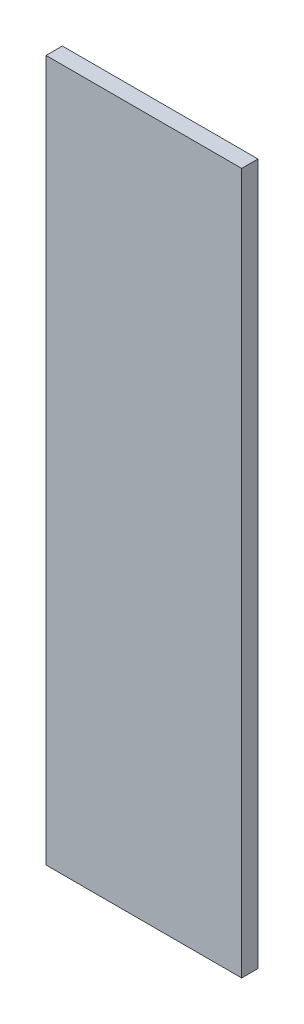
ISO-10303-21;
HEADER;
FILE_DESCRIPTION(('STEP AP214'),'2;1');
FILE_NAME('part.step','',(''),(''),'','','');
FILE_SCHEMA(('AUTOMOTIVE_DESIGN { 1 0 10303 214 1 1 1 1 }'));
ENDSEC;
DATA;
#1=APPLICATION_CONTEXT('core data for automotive mechanical design processes');
#2=APPLICATION_PROTOCOL_DEFINITION('international standard','automotive_design',2000,#1);
#3=PRODUCT_CONTEXT('',#1,'mechanical');
#4=PRODUCT('Part','Part','',(#3));
#5=PRODUCT_RELATED_PRODUCT_CATEGORY('part','',(#4));
#6=PRODUCT_DEFINITION_FORMATION('','',#4);
#7=PRODUCT_DEFINITION_CONTEXT('part definition',#1,'design');
#8=PRODUCT_DEFINITION('design','',#6,#7);
#9=PRODUCT_DEFINITION_SHAPE('','',#8);
#10=(LENGTH_UNIT() NAMED_UNIT(*) SI_UNIT(.MILLI.,.METRE.));
#11=(NAMED_UNIT(*) PLANE_ANGLE_UNIT() SI_UNIT($,.RADIAN.));
#12=(NAMED_UNIT(*) SI_UNIT($,.STERADIAN.) SOLID_ANGLE_UNIT());
#13=UNCERTAINTY_MEASURE_WITH_UNIT(LENGTH_MEASURE(1.E-05),#10,'distance_accuracy_value','');
#14=(GEOMETRIC_REPRESENTATION_CONTEXT(3) GLOBAL_UNCERTAINTY_ASSIGNED_CONTEXT((#13)) GLOBAL_UNIT_ASSIGNED_CONTEXT((#10,
#11,#12)) REPRESENTATION_CONTEXT('',''));
#15=CARTESIAN_POINT('',(0.,0.,0.));
#16=DIRECTION('',(0.,0.,1.));
#17=DIRECTION('',(1.,0.,0.));
#18=AXIS2_PLACEMENT_3D('',#15,#16,#17);
#19=CARTESIAN_POINT('',(0.,222.25,12.7));
#20=DIRECTION('',(1.,0.,0.));
#21=DIRECTION('',(0.,1.,0.));
#22=AXIS2_PLACEMENT_3D('',#19,#20,#21);
#23=PLANE('',#22);
#24=DIRECTION('',(0.,-1.,0.));
#25=VECTOR('',#24,1.);
#26=CARTESIAN_POINT('',(0.,222.25,0.));
#27=LINE('',#26,#25);
#28=CARTESIAN_POINT('',(0.,222.25,0.));
#29=VERTEX_POINT('',#28);
#30=CARTESIAN_POINT('',(0.,-323.85,0.));
#31=VERTEX_POINT('',#30);
#32=EDGE_CURVE('E98',#29,#31,#27,.T.);
#33=ORIENTED_EDGE('',*,*,#32,.T.);
#34=DIRECTION('',(0.,0.,-1.));
#35=VECTOR('',#34,1.);
#36=CARTESIAN_POINT('',(0.,-323.85,12.7));
#37=LINE('',#36,#35);
#38=CARTESIAN_POINT('',(0.,-323.85,12.7));
#39=VERTEX_POINT('',#38);
#40=EDGE_CURVE('E11',#39,#31,#37,.T.);
#41=ORIENTED_EDGE('',*,*,#40,.F.);
#42=DIRECTION('',(0.,-1.,0.));
#43=VECTOR('',#42,1.);
#44=CARTESIAN_POINT('',(0.,222.25,12.7));
#45=LINE('',#44,#43);
#46=CARTESIAN_POINT('',(0.,222.25,12.7));
#47=VERTEX_POINT('',#46);
#48=EDGE_CURVE('E86',#47,#39,#45,.T.);
#49=ORIENTED_EDGE('',*,*,#48,.F.);
#50=DIRECTION('',(0.,0.,-1.));
#51=VECTOR('',#50,1.);
#52=CARTESIAN_POINT('',(0.,222.25,12.7));
#53=LINE('',#52,#51);
#54=EDGE_CURVE('E94',#47,#29,#53,.T.);
#55=ORIENTED_EDGE('',*,*,#54,.T.);
#56=EDGE_LOOP('',(#33,#41,#49,#55));
#57=FACE_BOUND('',#56,.T.);
#58=ADVANCED_FACE('F35',(#57),#23,.F.);
#59=CARTESIAN_POINT('',(0.,-323.85,12.7));
#60=DIRECTION('',(0.,1.,0.));
#61=DIRECTION('',(0.,0.,1.));
#62=AXIS2_PLACEMENT_3D('',#59,#60,#61);
#63=PLANE('',#62);
#64=DIRECTION('',(1.,0.,0.));
#65=VECTOR('',#64,1.);
#66=CARTESIAN_POINT('',(0.,-323.85,0.));
#67=LINE('',#66,#65);
#68=CARTESIAN_POINT('',(152.4,-323.85,0.));
#69=VERTEX_POINT('',#68);
#70=EDGE_CURVE('E90',#31,#69,#67,.T.);
#71=ORIENTED_EDGE('',*,*,#70,.T.);
#72=DIRECTION('',(0.,0.,-1.));
#73=VECTOR('',#72,1.);
#74=CARTESIAN_POINT('',(152.4,-323.85,12.7));
#75=LINE('',#74,#73);
#76=CARTESIAN_POINT('',(152.4,-323.85,12.7));
#77=VERTEX_POINT('',#76);
#78=EDGE_CURVE('E43',#77,#69,#75,.T.);
#79=ORIENTED_EDGE('',*,*,#78,.F.);
#80=DIRECTION('',(1.,0.,0.));
#81=VECTOR('',#80,1.);
#82=CARTESIAN_POINT('',(0.,-323.85,12.7));
#83=LINE('',#82,#81);
#84=EDGE_CURVE('E81',#39,#77,#83,.T.);
#85=ORIENTED_EDGE('',*,*,#84,.F.);
#86=ORIENTED_EDGE('',*,*,#40,.T.);
#87=EDGE_LOOP('',(#71,#79,#85,#86));
#88=FACE_BOUND('',#87,.T.);
#89=ADVANCED_FACE('F89',(#88),#63,.F.);
#90=CARTESIAN_POINT('',(152.4,222.25,12.7));
#91=DIRECTION('',(-1.,0.,0.));
#92=DIRECTION('',(0.,-1.,0.));
#93=AXIS2_PLACEMENT_3D('',#90,#91,#92);
#94=PLANE('',#93);
#95=DIRECTION('',(0.,1.,0.));
#96=VECTOR('',#95,1.);
#97=CARTESIAN_POINT('',(152.4,222.25,0.));
#98=LINE('',#97,#96);
#99=CARTESIAN_POINT('',(152.4,222.25,0.));
#100=VERTEX_POINT('',#99);
#101=EDGE_CURVE('E68',#69,#100,#98,.T.);
#102=ORIENTED_EDGE('',*,*,#101,.T.);
#103=DIRECTION('',(0.,0.,-1.));
#104=VECTOR('',#103,1.);
#105=CARTESIAN_POINT('',(152.4,222.25,12.7));
#106=LINE('',#105,#104);
#107=CARTESIAN_POINT('',(152.4,222.25,12.7));
#108=VERTEX_POINT('',#107);
#109=EDGE_CURVE('E91',#108,#100,#106,.T.);
#110=ORIENTED_EDGE('',*,*,#109,.F.);
#111=DIRECTION('',(0.,1.,0.));
#112=VECTOR('',#111,1.);
#113=CARTESIAN_POINT('',(152.4,222.25,12.7));
#114=LINE('',#113,#112);
#115=EDGE_CURVE('E84',#77,#108,#114,.T.);
#116=ORIENTED_EDGE('',*,*,#115,.F.);
#117=ORIENTED_EDGE('',*,*,#78,.T.);
#118=EDGE_LOOP('',(#102,#110,#116,#117));
#119=FACE_BOUND('',#118,.T.);
#120=ADVANCED_FACE('F92',(#119),#94,.F.);
#121=CARTESIAN_POINT('',(0.,222.25,12.7));
#122=DIRECTION('',(0.,-1.,0.));
#123=DIRECTION('',(0.,0.,-1.));
#124=AXIS2_PLACEMENT_3D('',#121,#122,#123);
#125=PLANE('',#124);
#126=DIRECTION('',(-1.,0.,0.));
#127=VECTOR('',#126,1.);
#128=CARTESIAN_POINT('',(0.,222.25,0.));
#129=LINE('',#128,#127);
#130=EDGE_CURVE('E74',#100,#29,#129,.T.);
#131=ORIENTED_EDGE('',*,*,#130,.T.);
#132=ORIENTED_EDGE('',*,*,#54,.F.);
#133=DIRECTION('',(-1.,0.,0.));
#134=VECTOR('',#133,1.);
#135=CARTESIAN_POINT('',(0.,222.25,12.7));
#136=LINE('',#135,#134);
#137=EDGE_CURVE('E51',#108,#47,#136,.T.);
#138=ORIENTED_EDGE('',*,*,#137,.F.);
#139=ORIENTED_EDGE('',*,*,#109,.T.);
#140=EDGE_LOOP('',(#131,#132,#138,#139));
#141=FACE_BOUND('',#140,.T.);
#142=ADVANCED_FACE('F105',(#141),#125,.F.);
#143=CARTESIAN_POINT('',(0.,-323.85,12.7));
#144=DIRECTION('',(0.,0.,1.));
#145=DIRECTION('',(1.,0.,0.));
#146=AXIS2_PLACEMENT_3D('',#143,#144,#145);
#147=PLANE('',#146);
#148=ORIENTED_EDGE('',*,*,#48,.T.);
#149=ORIENTED_EDGE('',*,*,#84,.T.);
#150=ORIENTED_EDGE('',*,*,#115,.T.);
#151=ORIENTED_EDGE('',*,*,#137,.T.);
#152=EDGE_LOOP('',(#148,#149,#150,#151));
#153=FACE_BOUND('',#152,.T.);
#154=ADVANCED_FACE('F82',(#153),#147,.T.);
#155=CARTESIAN_POINT('',(0.,-323.85,0.));
#156=DIRECTION('',(0.,0.,1.));
#157=DIRECTION('',(1.,0.,0.));
#158=AXIS2_PLACEMENT_3D('',#155,#156,#157);
#159=PLANE('',#158);
#160=ORIENTED_EDGE('',*,*,#32,.F.);
#161=ORIENTED_EDGE('',*,*,#130,.F.);
#162=ORIENTED_EDGE('',*,*,#101,.F.);
#163=ORIENTED_EDGE('',*,*,#70,.F.);
#164=EDGE_LOOP('',(#160,#161,#162,#163));
#165=FACE_BOUND('',#164,.T.);
#166=ADVANCED_FACE('F108',(#165),#159,.F.);
#167=CLOSED_SHELL('',(#58,#89,#120,#142,#154,#166));
#168=MANIFOLD_SOLID_BREP('B2',#167);
#169=ADVANCED_BREP_SHAPE_REPRESENTATION('',(#18,#168),#14);
#170=SHAPE_DEFINITION_REPRESENTATION(#9,#169);
ENDSEC;
END-ISO-10303-21;
